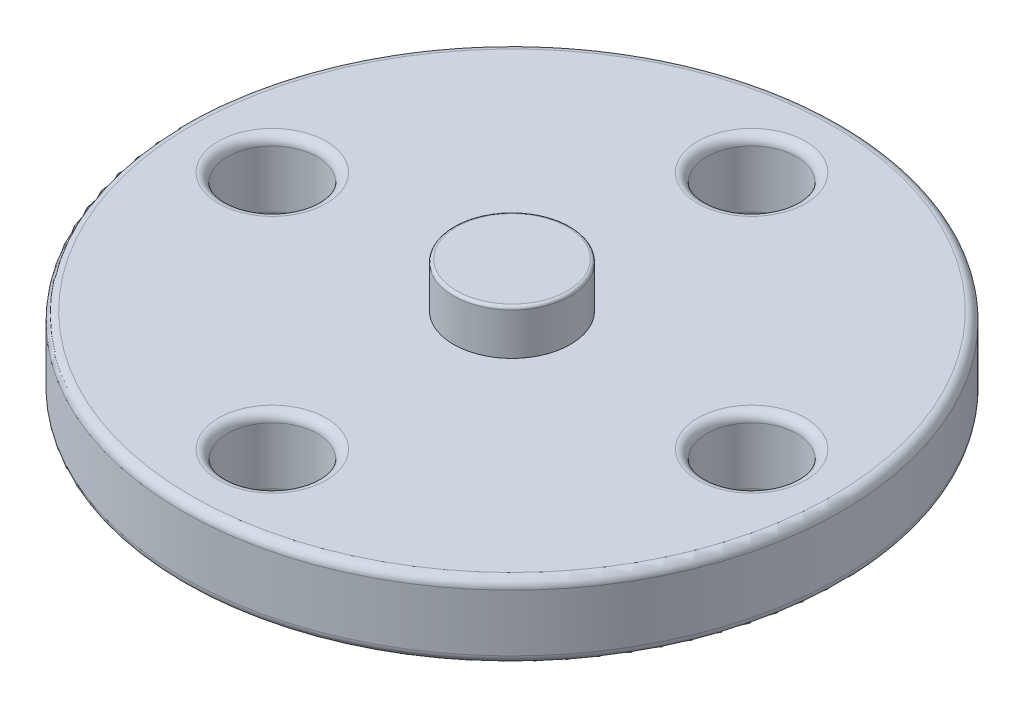
ISO-10303-21;
HEADER;
FILE_DESCRIPTION(('STEP AP214'),'2;1');
FILE_NAME('part.step','',(''),(''),'','','');
FILE_SCHEMA(('AUTOMOTIVE_DESIGN { 1 0 10303 214 1 1 1 1 }'));
ENDSEC;
DATA;
#1=APPLICATION_CONTEXT('core data for automotive mechanical design processes');
#2=APPLICATION_PROTOCOL_DEFINITION('international standard','automotive_design',2000,#1);
#3=PRODUCT_CONTEXT('',#1,'mechanical');
#4=PRODUCT('Part','Part','',(#3));
#5=PRODUCT_RELATED_PRODUCT_CATEGORY('part','',(#4));
#6=PRODUCT_DEFINITION_FORMATION('','',#4);
#7=PRODUCT_DEFINITION_CONTEXT('part definition',#1,'design');
#8=PRODUCT_DEFINITION('design','',#6,#7);
#9=PRODUCT_DEFINITION_SHAPE('','',#8);
#10=(LENGTH_UNIT() NAMED_UNIT(*) SI_UNIT(.MILLI.,.METRE.));
#11=(NAMED_UNIT(*) PLANE_ANGLE_UNIT() SI_UNIT($,.RADIAN.));
#12=(NAMED_UNIT(*) SI_UNIT($,.STERADIAN.) SOLID_ANGLE_UNIT());
#13=UNCERTAINTY_MEASURE_WITH_UNIT(LENGTH_MEASURE(1.E-05),#10,'distance_accuracy_value','');
#14=(GEOMETRIC_REPRESENTATION_CONTEXT(3) GLOBAL_UNCERTAINTY_ASSIGNED_CONTEXT((#13)) GLOBAL_UNIT_ASSIGNED_CONTEXT((#10,
#11,#12)) REPRESENTATION_CONTEXT('',''));
#15=CARTESIAN_POINT('',(0.,0.,0.));
#16=DIRECTION('',(0.,0.,1.));
#17=DIRECTION('',(1.,0.,0.));
#18=AXIS2_PLACEMENT_3D('',#15,#16,#17);
#19=CARTESIAN_POINT('',(0.,2.5,8.));
#20=DIRECTION('',(0.,-1.,0.));
#21=DIRECTION('',(0.,0.,-1.));
#22=AXIS2_PLACEMENT_3D('',#19,#20,#21);
#23=CYLINDRICAL_SURFACE('',#22,1.5);
#24=CARTESIAN_POINT('',(0.,0.3,8.));
#25=DIRECTION('',(0.,1.,0.));
#26=DIRECTION('',(0.,0.,1.));
#27=AXIS2_PLACEMENT_3D('',#24,#25,#26);
#28=CIRCLE('',#27,1.5);
#29=CARTESIAN_POINT('',(0.,0.3,9.5));
#30=VERTEX_POINT('',#29);
#31=EDGE_CURVE('E87',#30,#30,#28,.F.);
#32=ORIENTED_EDGE('',*,*,#31,.T.);
#33=EDGE_LOOP('',(#32));
#34=FACE_BOUND('',#33,.T.);
#35=CARTESIAN_POINT('',(0.,2.2,8.));
#36=DIRECTION('',(0.,1.,0.));
#37=DIRECTION('',(0.,0.,1.));
#38=AXIS2_PLACEMENT_3D('',#35,#36,#37);
#39=CIRCLE('',#38,1.5);
#40=CARTESIAN_POINT('',(0.,2.2,9.5));
#41=VERTEX_POINT('',#40);
#42=EDGE_CURVE('E91',#41,#41,#39,.T.);
#43=ORIENTED_EDGE('',*,*,#42,.T.);
#44=EDGE_LOOP('',(#43));
#45=FACE_BOUND('',#44,.T.);
#46=ADVANCED_FACE('F43',(#34,#45),#23,.F.);
#47=CARTESIAN_POINT('',(8.,2.5,0.));
#48=DIRECTION('',(0.,-1.,0.));
#49=DIRECTION('',(0.,0.,-1.));
#50=AXIS2_PLACEMENT_3D('',#47,#48,#49);
#51=CYLINDRICAL_SURFACE('',#50,1.5);
#52=CARTESIAN_POINT('',(8.,0.3,0.));
#53=DIRECTION('',(0.,1.,0.));
#54=DIRECTION('',(0.,0.,1.));
#55=AXIS2_PLACEMENT_3D('',#52,#53,#54);
#56=CIRCLE('',#55,1.5);
#57=CARTESIAN_POINT('',(8.,0.3,1.49999999999997));
#58=VERTEX_POINT('',#57);
#59=EDGE_CURVE('E95',#58,#58,#56,.F.);
#60=ORIENTED_EDGE('',*,*,#59,.T.);
#61=EDGE_LOOP('',(#60));
#62=FACE_BOUND('',#61,.T.);
#63=CARTESIAN_POINT('',(8.,2.2,0.));
#64=DIRECTION('',(0.,1.,0.));
#65=DIRECTION('',(0.,0.,1.));
#66=AXIS2_PLACEMENT_3D('',#63,#64,#65);
#67=CIRCLE('',#66,1.5);
#68=CARTESIAN_POINT('',(8.,2.2,1.49999999999997));
#69=VERTEX_POINT('',#68);
#70=EDGE_CURVE('E99',#69,#69,#67,.T.);
#71=ORIENTED_EDGE('',*,*,#70,.T.);
#72=EDGE_LOOP('',(#71));
#73=FACE_BOUND('',#72,.T.);
#74=ADVANCED_FACE('F177',(#62,#73),#51,.F.);
#75=CARTESIAN_POINT('',(0.,2.5,-8.));
#76=DIRECTION('',(0.,-1.,0.));
#77=DIRECTION('',(0.,0.,-1.));
#78=AXIS2_PLACEMENT_3D('',#75,#76,#77);
#79=CYLINDRICAL_SURFACE('',#78,1.5);
#80=CARTESIAN_POINT('',(0.,0.3,-8.));
#81=DIRECTION('',(0.,1.,0.));
#82=DIRECTION('',(0.,0.,1.));
#83=AXIS2_PLACEMENT_3D('',#80,#81,#82);
#84=CIRCLE('',#83,1.5);
#85=CARTESIAN_POINT('',(0.,0.3,-6.5));
#86=VERTEX_POINT('',#85);
#87=EDGE_CURVE('E103',#86,#86,#84,.F.);
#88=ORIENTED_EDGE('',*,*,#87,.T.);
#89=EDGE_LOOP('',(#88));
#90=FACE_BOUND('',#89,.T.);
#91=CARTESIAN_POINT('',(0.,2.2,-8.));
#92=DIRECTION('',(0.,1.,0.));
#93=DIRECTION('',(0.,0.,1.));
#94=AXIS2_PLACEMENT_3D('',#91,#92,#93);
#95=CIRCLE('',#94,1.5);
#96=CARTESIAN_POINT('',(0.,2.2,-6.5));
#97=VERTEX_POINT('',#96);
#98=EDGE_CURVE('E107',#97,#97,#95,.T.);
#99=ORIENTED_EDGE('',*,*,#98,.T.);
#100=EDGE_LOOP('',(#99));
#101=FACE_BOUND('',#100,.T.);
#102=ADVANCED_FACE('F183',(#90,#101),#79,.F.);
#103=CARTESIAN_POINT('',(-8.,2.5,0.));
#104=DIRECTION('',(0.,-1.,0.));
#105=DIRECTION('',(0.,0.,-1.));
#106=AXIS2_PLACEMENT_3D('',#103,#104,#105);
#107=CYLINDRICAL_SURFACE('',#106,1.5);
#108=CARTESIAN_POINT('',(-8.,0.3,0.));
#109=DIRECTION('',(0.,1.,0.));
#110=DIRECTION('',(0.,0.,1.));
#111=AXIS2_PLACEMENT_3D('',#108,#109,#110);
#112=CIRCLE('',#111,1.5);
#113=CARTESIAN_POINT('',(-8.,0.3,1.50000000000003));
#114=VERTEX_POINT('',#113);
#115=EDGE_CURVE('E111',#114,#114,#112,.F.);
#116=ORIENTED_EDGE('',*,*,#115,.T.);
#117=EDGE_LOOP('',(#116));
#118=FACE_BOUND('',#117,.T.);
#119=CARTESIAN_POINT('',(-8.,2.2,0.));
#120=DIRECTION('',(0.,1.,0.));
#121=DIRECTION('',(0.,0.,1.));
#122=AXIS2_PLACEMENT_3D('',#119,#120,#121);
#123=CIRCLE('',#122,1.5);
#124=CARTESIAN_POINT('',(-8.,2.2,1.50000000000003));
#125=VERTEX_POINT('',#124);
#126=EDGE_CURVE('E115',#125,#125,#123,.T.);
#127=ORIENTED_EDGE('',*,*,#126,.T.);
#128=EDGE_LOOP('',(#127));
#129=FACE_BOUND('',#128,.T.);
#130=ADVANCED_FACE('F192',(#118,#129),#107,.F.);
#131=CARTESIAN_POINT('',(0.,2.5,0.));
#132=DIRECTION('',(0.,-1.,0.));
#133=DIRECTION('',(0.,0.,-1.));
#134=AXIS2_PLACEMENT_3D('',#131,#132,#133);
#135=CYLINDRICAL_SURFACE('',#134,11.);
#136=CARTESIAN_POINT('',(0.,0.3,0.));
#137=DIRECTION('',(0.,1.,0.));
#138=DIRECTION('',(0.,0.,1.));
#139=AXIS2_PLACEMENT_3D('',#136,#137,#138);
#140=CIRCLE('',#139,11.);
#141=CARTESIAN_POINT('',(0.,0.3,11.));
#142=VERTEX_POINT('',#141);
#143=EDGE_CURVE('E79',#142,#142,#140,.T.);
#144=ORIENTED_EDGE('',*,*,#143,.T.);
#145=EDGE_LOOP('',(#144));
#146=FACE_BOUND('',#145,.T.);
#147=CARTESIAN_POINT('',(0.,2.2,0.));
#148=DIRECTION('',(0.,1.,0.));
#149=DIRECTION('',(0.,0.,1.));
#150=AXIS2_PLACEMENT_3D('',#147,#148,#149);
#151=CIRCLE('',#150,11.);
#152=CARTESIAN_POINT('',(0.,2.2,11.));
#153=VERTEX_POINT('',#152);
#154=EDGE_CURVE('E83',#153,#153,#151,.F.);
#155=ORIENTED_EDGE('',*,*,#154,.T.);
#156=EDGE_LOOP('',(#155));
#157=FACE_BOUND('',#156,.T.);
#158=ADVANCED_FACE('F150',(#146,#157),#135,.T.);
#159=CARTESIAN_POINT('',(0.,2.5,0.));
#160=DIRECTION('',(0.,1.,0.));
#161=DIRECTION('',(0.,0.,1.));
#162=AXIS2_PLACEMENT_3D('',#159,#160,#161);
#163=PLANE('',#162);
#164=CARTESIAN_POINT('',(0.,2.5,0.));
#165=DIRECTION('',(0.,1.,0.));
#166=DIRECTION('',(0.,0.,1.));
#167=AXIS2_PLACEMENT_3D('',#164,#165,#166);
#168=CIRCLE('',#167,1.95);
#169=CARTESIAN_POINT('',(0.,2.5,1.95));
#170=VERTEX_POINT('',#169);
#171=EDGE_CURVE('E139',#170,#170,#168,.T.);
#172=ORIENTED_EDGE('',*,*,#171,.F.);
#173=EDGE_LOOP('',(#172));
#174=FACE_BOUND('',#173,.T.);
#175=CARTESIAN_POINT('',(-8.,2.5,0.));
#176=DIRECTION('',(0.,1.,0.));
#177=DIRECTION('',(0.,0.,1.));
#178=AXIS2_PLACEMENT_3D('',#175,#176,#177);
#179=CIRCLE('',#178,1.8);
#180=CARTESIAN_POINT('',(-8.,2.5,1.80000000000003));
#181=VERTEX_POINT('',#180);
#182=EDGE_CURVE('E56',#181,#181,#179,.F.);
#183=ORIENTED_EDGE('',*,*,#182,.T.);
#184=EDGE_LOOP('',(#183));
#185=FACE_BOUND('',#184,.T.);
#186=CARTESIAN_POINT('',(0.,2.5,-8.));
#187=DIRECTION('',(0.,1.,0.));
#188=DIRECTION('',(0.,0.,1.));
#189=AXIS2_PLACEMENT_3D('',#186,#187,#188);
#190=CIRCLE('',#189,1.8);
#191=CARTESIAN_POINT('',(0.,2.5,-6.2));
#192=VERTEX_POINT('',#191);
#193=EDGE_CURVE('E61',#192,#192,#190,.F.);
#194=ORIENTED_EDGE('',*,*,#193,.T.);
#195=EDGE_LOOP('',(#194));
#196=FACE_BOUND('',#195,.T.);
#197=CARTESIAN_POINT('',(8.,2.5,0.));
#198=DIRECTION('',(0.,1.,0.));
#199=DIRECTION('',(0.,0.,1.));
#200=AXIS2_PLACEMENT_3D('',#197,#198,#199);
#201=CIRCLE('',#200,1.8);
#202=CARTESIAN_POINT('',(8.,2.5,1.79999999999997));
#203=VERTEX_POINT('',#202);
#204=EDGE_CURVE('E67',#203,#203,#201,.F.);
#205=ORIENTED_EDGE('',*,*,#204,.T.);
#206=EDGE_LOOP('',(#205));
#207=FACE_BOUND('',#206,.T.);
#208=CARTESIAN_POINT('',(0.,2.5,8.));
#209=DIRECTION('',(0.,1.,0.));
#210=DIRECTION('',(0.,0.,1.));
#211=AXIS2_PLACEMENT_3D('',#208,#209,#210);
#212=CIRCLE('',#211,1.8);
#213=CARTESIAN_POINT('',(0.,2.5,9.8));
#214=VERTEX_POINT('',#213);
#215=EDGE_CURVE('E71',#214,#214,#212,.F.);
#216=ORIENTED_EDGE('',*,*,#215,.T.);
#217=EDGE_LOOP('',(#216));
#218=FACE_BOUND('',#217,.T.);
#219=CARTESIAN_POINT('',(0.,2.5,0.));
#220=DIRECTION('',(0.,1.,0.));
#221=DIRECTION('',(0.,0.,1.));
#222=AXIS2_PLACEMENT_3D('',#219,#220,#221);
#223=CIRCLE('',#222,10.7);
#224=CARTESIAN_POINT('',(0.,2.5,10.7));
#225=VERTEX_POINT('',#224);
#226=EDGE_CURVE('E75',#225,#225,#223,.T.);
#227=ORIENTED_EDGE('',*,*,#226,.T.);
#228=EDGE_LOOP('',(#227));
#229=FACE_BOUND('',#228,.T.);
#230=ADVANCED_FACE('F146',(#174,#185,#196,#207,#218,#229),#163,.T.);
#231=CARTESIAN_POINT('',(0.,0.,0.));
#232=DIRECTION('',(0.,1.,0.));
#233=DIRECTION('',(0.,0.,1.));
#234=AXIS2_PLACEMENT_3D('',#231,#232,#233);
#235=PLANE('',#234);
#236=CARTESIAN_POINT('',(-8.,0.,0.));
#237=DIRECTION('',(0.,1.,0.));
#238=DIRECTION('',(0.,0.,1.));
#239=AXIS2_PLACEMENT_3D('',#236,#237,#238);
#240=CIRCLE('',#239,1.8);
#241=CARTESIAN_POINT('',(-8.,0.,1.80000000000003));
#242=VERTEX_POINT('',#241);
#243=EDGE_CURVE('E119',#242,#242,#240,.T.);
#244=ORIENTED_EDGE('',*,*,#243,.T.);
#245=EDGE_LOOP('',(#244));
#246=FACE_BOUND('',#245,.T.);
#247=CARTESIAN_POINT('',(0.,0.,-8.));
#248=DIRECTION('',(0.,1.,0.));
#249=DIRECTION('',(0.,0.,1.));
#250=AXIS2_PLACEMENT_3D('',#247,#248,#249);
#251=CIRCLE('',#250,1.8);
#252=CARTESIAN_POINT('',(0.,0.,-6.2));
#253=VERTEX_POINT('',#252);
#254=EDGE_CURVE('E123',#253,#253,#251,.T.);
#255=ORIENTED_EDGE('',*,*,#254,.T.);
#256=EDGE_LOOP('',(#255));
#257=FACE_BOUND('',#256,.T.);
#258=CARTESIAN_POINT('',(8.,0.,0.));
#259=DIRECTION('',(0.,1.,0.));
#260=DIRECTION('',(0.,0.,1.));
#261=AXIS2_PLACEMENT_3D('',#258,#259,#260);
#262=CIRCLE('',#261,1.8);
#263=CARTESIAN_POINT('',(8.,0.,1.79999999999997));
#264=VERTEX_POINT('',#263);
#265=EDGE_CURVE('E127',#264,#264,#262,.T.);
#266=ORIENTED_EDGE('',*,*,#265,.T.);
#267=EDGE_LOOP('',(#266));
#268=FACE_BOUND('',#267,.T.);
#269=CARTESIAN_POINT('',(0.,0.,8.));
#270=DIRECTION('',(0.,1.,0.));
#271=DIRECTION('',(0.,0.,1.));
#272=AXIS2_PLACEMENT_3D('',#269,#270,#271);
#273=CIRCLE('',#272,1.8);
#274=CARTESIAN_POINT('',(0.,0.,9.8));
#275=VERTEX_POINT('',#274);
#276=EDGE_CURVE('E131',#275,#275,#273,.T.);
#277=ORIENTED_EDGE('',*,*,#276,.T.);
#278=EDGE_LOOP('',(#277));
#279=FACE_BOUND('',#278,.T.);
#280=CARTESIAN_POINT('',(0.,0.,0.));
#281=DIRECTION('',(0.,1.,0.));
#282=DIRECTION('',(0.,0.,1.));
#283=AXIS2_PLACEMENT_3D('',#280,#281,#282);
#284=CIRCLE('',#283,10.7);
#285=CARTESIAN_POINT('',(0.,0.,10.7));
#286=VERTEX_POINT('',#285);
#287=EDGE_CURVE('E135',#286,#286,#284,.F.);
#288=ORIENTED_EDGE('',*,*,#287,.T.);
#289=EDGE_LOOP('',(#288));
#290=FACE_BOUND('',#289,.T.);
#291=ADVANCED_FACE('F149',(#246,#257,#268,#279,#290),#235,.F.);
#292=CARTESIAN_POINT('',(-8.,0.3,0.));
#293=DIRECTION('',(0.,1.,0.));
#294=DIRECTION('',(0.,0.,1.));
#295=AXIS2_PLACEMENT_3D('',#292,#293,#294);
#296=TOROIDAL_SURFACE('',#295,1.8,0.3);
#297=ORIENTED_EDGE('',*,*,#115,.F.);
#298=EDGE_LOOP('',(#297));
#299=FACE_BOUND('',#298,.T.);
#300=ORIENTED_EDGE('',*,*,#243,.F.);
#301=EDGE_LOOP('',(#300));
#302=FACE_BOUND('',#301,.T.);
#303=ADVANCED_FACE('F197',(#299,#302),#296,.T.);
#304=CARTESIAN_POINT('',(0.,0.3,-8.));
#305=DIRECTION('',(0.,1.,0.));
#306=DIRECTION('',(0.,0.,1.));
#307=AXIS2_PLACEMENT_3D('',#304,#305,#306);
#308=TOROIDAL_SURFACE('',#307,1.8,0.3);
#309=ORIENTED_EDGE('',*,*,#87,.F.);
#310=EDGE_LOOP('',(#309));
#311=FACE_BOUND('',#310,.T.);
#312=ORIENTED_EDGE('',*,*,#254,.F.);
#313=EDGE_LOOP('',(#312));
#314=FACE_BOUND('',#313,.T.);
#315=ADVANCED_FACE('F200',(#311,#314),#308,.T.);
#316=CARTESIAN_POINT('',(8.,0.3,0.));
#317=DIRECTION('',(0.,1.,0.));
#318=DIRECTION('',(0.,0.,1.));
#319=AXIS2_PLACEMENT_3D('',#316,#317,#318);
#320=TOROIDAL_SURFACE('',#319,1.8,0.3);
#321=ORIENTED_EDGE('',*,*,#59,.F.);
#322=EDGE_LOOP('',(#321));
#323=FACE_BOUND('',#322,.T.);
#324=ORIENTED_EDGE('',*,*,#265,.F.);
#325=EDGE_LOOP('',(#324));
#326=FACE_BOUND('',#325,.T.);
#327=ADVANCED_FACE('F204',(#323,#326),#320,.T.);
#328=CARTESIAN_POINT('',(0.,0.3,8.));
#329=DIRECTION('',(0.,1.,0.));
#330=DIRECTION('',(0.,0.,1.));
#331=AXIS2_PLACEMENT_3D('',#328,#329,#330);
#332=TOROIDAL_SURFACE('',#331,1.8,0.3);
#333=ORIENTED_EDGE('',*,*,#31,.F.);
#334=EDGE_LOOP('',(#333));
#335=FACE_BOUND('',#334,.T.);
#336=ORIENTED_EDGE('',*,*,#276,.F.);
#337=EDGE_LOOP('',(#336));
#338=FACE_BOUND('',#337,.T.);
#339=ADVANCED_FACE('F208',(#335,#338),#332,.T.);
#340=CARTESIAN_POINT('',(0.,0.3,0.));
#341=DIRECTION('',(0.,1.,0.));
#342=DIRECTION('',(0.,0.,1.));
#343=AXIS2_PLACEMENT_3D('',#340,#341,#342);
#344=TOROIDAL_SURFACE('',#343,10.7,0.3);
#345=ORIENTED_EDGE('',*,*,#287,.F.);
#346=EDGE_LOOP('',(#345));
#347=FACE_BOUND('',#346,.T.);
#348=ORIENTED_EDGE('',*,*,#143,.F.);
#349=EDGE_LOOP('',(#348));
#350=FACE_BOUND('',#349,.T.);
#351=ADVANCED_FACE('F212',(#347,#350),#344,.T.);
#352=CARTESIAN_POINT('',(-8.,2.2,0.));
#353=DIRECTION('',(0.,1.,0.));
#354=DIRECTION('',(0.,0.,1.));
#355=AXIS2_PLACEMENT_3D('',#352,#353,#354);
#356=TOROIDAL_SURFACE('',#355,1.8,0.3);
#357=ORIENTED_EDGE('',*,*,#182,.F.);
#358=EDGE_LOOP('',(#357));
#359=FACE_BOUND('',#358,.T.);
#360=ORIENTED_EDGE('',*,*,#126,.F.);
#361=EDGE_LOOP('',(#360));
#362=FACE_BOUND('',#361,.T.);
#363=ADVANCED_FACE('F216',(#359,#362),#356,.T.);
#364=CARTESIAN_POINT('',(0.,2.2,-8.));
#365=DIRECTION('',(0.,1.,0.));
#366=DIRECTION('',(0.,0.,1.));
#367=AXIS2_PLACEMENT_3D('',#364,#365,#366);
#368=TOROIDAL_SURFACE('',#367,1.8,0.3);
#369=ORIENTED_EDGE('',*,*,#193,.F.);
#370=EDGE_LOOP('',(#369));
#371=FACE_BOUND('',#370,.T.);
#372=ORIENTED_EDGE('',*,*,#98,.F.);
#373=EDGE_LOOP('',(#372));
#374=FACE_BOUND('',#373,.T.);
#375=ADVANCED_FACE('F220',(#371,#374),#368,.T.);
#376=CARTESIAN_POINT('',(8.,2.2,0.));
#377=DIRECTION('',(0.,1.,0.));
#378=DIRECTION('',(0.,0.,1.));
#379=AXIS2_PLACEMENT_3D('',#376,#377,#378);
#380=TOROIDAL_SURFACE('',#379,1.8,0.3);
#381=ORIENTED_EDGE('',*,*,#204,.F.);
#382=EDGE_LOOP('',(#381));
#383=FACE_BOUND('',#382,.T.);
#384=ORIENTED_EDGE('',*,*,#70,.F.);
#385=EDGE_LOOP('',(#384));
#386=FACE_BOUND('',#385,.T.);
#387=ADVANCED_FACE('F172',(#383,#386),#380,.T.);
#388=CARTESIAN_POINT('',(0.,2.2,8.));
#389=DIRECTION('',(0.,1.,0.));
#390=DIRECTION('',(0.,0.,1.));
#391=AXIS2_PLACEMENT_3D('',#388,#389,#390);
#392=TOROIDAL_SURFACE('',#391,1.8,0.3);
#393=ORIENTED_EDGE('',*,*,#215,.F.);
#394=EDGE_LOOP('',(#393));
#395=FACE_BOUND('',#394,.T.);
#396=ORIENTED_EDGE('',*,*,#42,.F.);
#397=EDGE_LOOP('',(#396));
#398=FACE_BOUND('',#397,.T.);
#399=ADVANCED_FACE('F164',(#395,#398),#392,.T.);
#400=CARTESIAN_POINT('',(0.,2.2,0.));
#401=DIRECTION('',(0.,1.,0.));
#402=DIRECTION('',(0.,0.,1.));
#403=AXIS2_PLACEMENT_3D('',#400,#401,#402);
#404=TOROIDAL_SURFACE('',#403,10.7,0.3);
#405=ORIENTED_EDGE('',*,*,#154,.F.);
#406=EDGE_LOOP('',(#405));
#407=FACE_BOUND('',#406,.T.);
#408=ORIENTED_EDGE('',*,*,#226,.F.);
#409=EDGE_LOOP('',(#408));
#410=FACE_BOUND('',#409,.T.);
#411=ADVANCED_FACE('F162',(#407,#410),#404,.T.);
#412=CARTESIAN_POINT('',(0.,4.,0.));
#413=DIRECTION('',(0.,-1.,0.));
#414=DIRECTION('',(0.,0.,-1.));
#415=AXIS2_PLACEMENT_3D('',#412,#413,#414);
#416=CYLINDRICAL_SURFACE('',#415,1.95);
#417=CARTESIAN_POINT('',(0.,3.9,0.));
#418=DIRECTION('',(0.,1.,0.));
#419=DIRECTION('',(0.,0.,1.));
#420=AXIS2_PLACEMENT_3D('',#417,#418,#419);
#421=CIRCLE('',#420,1.95);
#422=CARTESIAN_POINT('',(0.,3.9,1.95));
#423=VERTEX_POINT('',#422);
#424=EDGE_CURVE('E10',#423,#423,#421,.F.);
#425=ORIENTED_EDGE('',*,*,#424,.T.);
#426=EDGE_LOOP('',(#425));
#427=FACE_BOUND('',#426,.T.);
#428=ORIENTED_EDGE('',*,*,#171,.T.);
#429=EDGE_LOOP('',(#428));
#430=FACE_BOUND('',#429,.T.);
#431=ADVANCED_FACE('F144',(#427,#430),#416,.T.);
#432=CARTESIAN_POINT('',(0.,4.,0.));
#433=DIRECTION('',(0.,1.,0.));
#434=DIRECTION('',(0.,0.,1.));
#435=AXIS2_PLACEMENT_3D('',#432,#433,#434);
#436=PLANE('',#435);
#437=CARTESIAN_POINT('',(0.,4.,0.));
#438=DIRECTION('',(0.,1.,0.));
#439=DIRECTION('',(0.,0.,1.));
#440=AXIS2_PLACEMENT_3D('',#437,#438,#439);
#441=CIRCLE('',#440,1.85);
#442=CARTESIAN_POINT('',(0.,4.,1.85));
#443=VERTEX_POINT('',#442);
#444=EDGE_CURVE('E51',#443,#443,#441,.T.);
#445=ORIENTED_EDGE('',*,*,#444,.T.);
#446=EDGE_LOOP('',(#445));
#447=FACE_BOUND('',#446,.T.);
#448=ADVANCED_FACE('F170',(#447),#436,.T.);
#449=CARTESIAN_POINT('',(0.,3.9,0.));
#450=DIRECTION('',(0.,1.,0.));
#451=DIRECTION('',(0.,0.,1.));
#452=AXIS2_PLACEMENT_3D('',#449,#450,#451);
#453=TOROIDAL_SURFACE('',#452,1.85,0.1);
#454=ORIENTED_EDGE('',*,*,#424,.F.);
#455=EDGE_LOOP('',(#454));
#456=FACE_BOUND('',#455,.T.);
#457=ORIENTED_EDGE('',*,*,#444,.F.);
#458=EDGE_LOOP('',(#457));
#459=FACE_BOUND('',#458,.T.);
#460=ADVANCED_FACE('F45',(#456,#459),#453,.T.);
#461=CLOSED_SHELL('',(#46,#74,#102,#130,#158,#230,#291,#303,#315,#327,#339,#351,#363,#375,#387,
#399,#411,#431,#448,#460));
#462=MANIFOLD_SOLID_BREP('B2',#461);
#463=ADVANCED_BREP_SHAPE_REPRESENTATION('',(#18,#462),#14);
#464=SHAPE_DEFINITION_REPRESENTATION(#9,#463);
ENDSEC;
END-ISO-10303-21;
